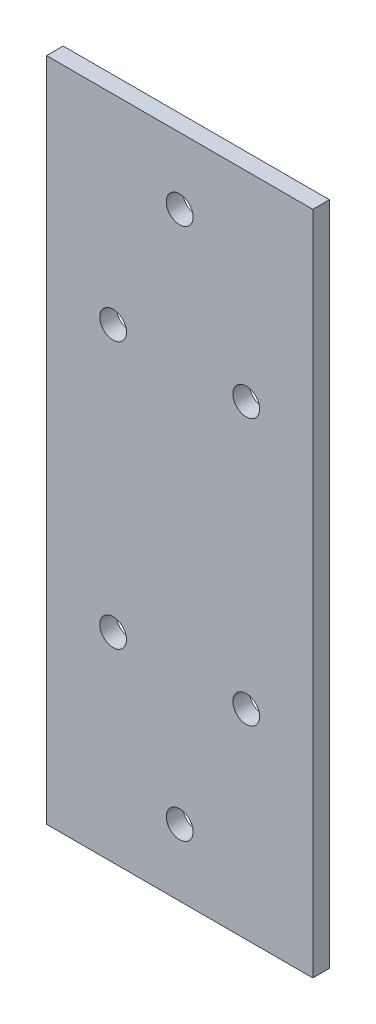
ISO-10303-21;
HEADER;
FILE_DESCRIPTION(('STEP AP214'),'2;1');
FILE_NAME('part.step','',(''),(''),'','','');
FILE_SCHEMA(('AUTOMOTIVE_DESIGN { 1 0 10303 214 1 1 1 1 }'));
ENDSEC;
DATA;
#1=APPLICATION_CONTEXT('core data for automotive mechanical design processes');
#2=APPLICATION_PROTOCOL_DEFINITION('international standard','automotive_design',2000,#1);
#3=PRODUCT_CONTEXT('',#1,'mechanical');
#4=PRODUCT('Part','Part','',(#3));
#5=PRODUCT_RELATED_PRODUCT_CATEGORY('part','',(#4));
#6=PRODUCT_DEFINITION_FORMATION('','',#4);
#7=PRODUCT_DEFINITION_CONTEXT('part definition',#1,'design');
#8=PRODUCT_DEFINITION('design','',#6,#7);
#9=PRODUCT_DEFINITION_SHAPE('','',#8);
#10=(LENGTH_UNIT() NAMED_UNIT(*) SI_UNIT(.MILLI.,.METRE.));
#11=(NAMED_UNIT(*) PLANE_ANGLE_UNIT() SI_UNIT($,.RADIAN.));
#12=(NAMED_UNIT(*) SI_UNIT($,.STERADIAN.) SOLID_ANGLE_UNIT());
#13=UNCERTAINTY_MEASURE_WITH_UNIT(LENGTH_MEASURE(1.E-05),#10,'distance_accuracy_value','');
#14=(GEOMETRIC_REPRESENTATION_CONTEXT(3) GLOBAL_UNCERTAINTY_ASSIGNED_CONTEXT((#13)) GLOBAL_UNIT_ASSIGNED_CONTEXT((#10,
#11,#12)) REPRESENTATION_CONTEXT('',''));
#15=CARTESIAN_POINT('',(0.,0.,0.));
#16=DIRECTION('',(0.,0.,1.));
#17=DIRECTION('',(1.,0.,0.));
#18=AXIS2_PLACEMENT_3D('',#15,#16,#17);
#19=CARTESIAN_POINT('',(0.,0.,3.175));
#20=DIRECTION('',(0.,0.,1.));
#21=DIRECTION('',(1.,0.,0.));
#22=AXIS2_PLACEMENT_3D('',#19,#20,#21);
#23=PLANE('',#22);
#24=CARTESIAN_POINT('',(-4.54801678557969,-76.7293177283185,3.175));
#25=DIRECTION('',(0.,0.,1.));
#26=DIRECTION('',(1.,0.,0.));
#27=AXIS2_PLACEMENT_3D('',#24,#25,#26);
#28=CIRCLE('',#27,2.5527);
#29=CARTESIAN_POINT('',(-1.9953167855797,-76.7293177283185,3.175));
#30=VERTEX_POINT('',#29);
#31=EDGE_CURVE('E133',#30,#30,#28,.T.);
#32=ORIENTED_EDGE('',*,*,#31,.F.);
#33=EDGE_LOOP('',(#32));
#34=FACE_BOUND('',#33,.T.);
#35=CARTESIAN_POINT('',(-4.5480167855797,-25.9293177283185,3.175));
#36=DIRECTION('',(0.,0.,1.));
#37=DIRECTION('',(1.,0.,0.));
#38=AXIS2_PLACEMENT_3D('',#35,#36,#37);
#39=CIRCLE('',#38,2.5527);
#40=CARTESIAN_POINT('',(-1.9953167855797,-25.9293177283185,3.175));
#41=VERTEX_POINT('',#40);
#42=EDGE_CURVE('E121',#41,#41,#39,.T.);
#43=ORIENTED_EDGE('',*,*,#42,.F.);
#44=EDGE_LOOP('',(#43));
#45=FACE_BOUND('',#44,.T.);
#46=CARTESIAN_POINT('',(-17.2480167855797,-0.529317728318502,3.175));
#47=DIRECTION('',(0.,0.,1.));
#48=DIRECTION('',(1.,0.,0.));
#49=AXIS2_PLACEMENT_3D('',#46,#47,#48);
#50=CIRCLE('',#49,2.5527);
#51=CARTESIAN_POINT('',(-14.6953167855797,-0.529317728318502,3.175));
#52=VERTEX_POINT('',#51);
#53=EDGE_CURVE('E100',#52,#52,#50,.T.);
#54=ORIENTED_EDGE('',*,*,#53,.F.);
#55=EDGE_LOOP('',(#54));
#56=FACE_BOUND('',#55,.T.);
#57=DIRECTION('',(0.,-1.,0.));
#58=VECTOR('',#57,1.);
#59=CARTESIAN_POINT('',(-42.6480167855797,12.1706822716815,3.175));
#60=LINE('',#59,#58);
#61=CARTESIAN_POINT('',(-42.6480167855797,12.1706822716815,3.175));
#62=VERTEX_POINT('',#61);
#63=CARTESIAN_POINT('',(-42.6480167855797,-114.829317728319,3.175));
#64=VERTEX_POINT('',#63);
#65=EDGE_CURVE('E85',#62,#64,#60,.T.);
#66=ORIENTED_EDGE('',*,*,#65,.T.);
#67=DIRECTION('',(1.,0.,0.));
#68=VECTOR('',#67,1.);
#69=CARTESIAN_POINT('',(-42.6480167855797,-114.829317728319,3.175));
#70=LINE('',#69,#68);
#71=CARTESIAN_POINT('',(8.15198321442031,-114.829317728319,3.175));
#72=VERTEX_POINT('',#71);
#73=EDGE_CURVE('E80',#64,#72,#70,.T.);
#74=ORIENTED_EDGE('',*,*,#73,.T.);
#75=DIRECTION('',(0.,1.,0.));
#76=VECTOR('',#75,1.);
#77=CARTESIAN_POINT('',(8.1519832144203,12.1706822716815,3.175));
#78=LINE('',#77,#76);
#79=CARTESIAN_POINT('',(8.1519832144203,12.1706822716815,3.175));
#80=VERTEX_POINT('',#79);
#81=EDGE_CURVE('E83',#72,#80,#78,.T.);
#82=ORIENTED_EDGE('',*,*,#81,.T.);
#83=DIRECTION('',(-1.,0.,0.));
#84=VECTOR('',#83,1.);
#85=CARTESIAN_POINT('',(-42.6480167855797,12.1706822716815,3.175));
#86=LINE('',#85,#84);
#87=EDGE_CURVE('E50',#80,#62,#86,.T.);
#88=ORIENTED_EDGE('',*,*,#87,.T.);
#89=EDGE_LOOP('',(#66,#74,#82,#88));
#90=FACE_BOUND('',#89,.T.);
#91=CARTESIAN_POINT('',(-29.9480167855797,-25.9293177283185,3.175));
#92=DIRECTION('',(0.,0.,1.));
#93=DIRECTION('',(1.,0.,0.));
#94=AXIS2_PLACEMENT_3D('',#91,#92,#93);
#95=CIRCLE('',#94,2.5527);
#96=CARTESIAN_POINT('',(-27.3953167855797,-25.9293177283185,3.175));
#97=VERTEX_POINT('',#96);
#98=EDGE_CURVE('E115',#97,#97,#95,.T.);
#99=ORIENTED_EDGE('',*,*,#98,.F.);
#100=EDGE_LOOP('',(#99));
#101=FACE_BOUND('',#100,.T.);
#102=CARTESIAN_POINT('',(-17.2480167855797,-102.129317728318,3.175));
#103=DIRECTION('',(0.,0.,1.));
#104=DIRECTION('',(1.,0.,0.));
#105=AXIS2_PLACEMENT_3D('',#102,#103,#104);
#106=CIRCLE('',#105,2.55269999999999);
#107=CARTESIAN_POINT('',(-14.6953167855797,-102.129317728318,3.175));
#108=VERTEX_POINT('',#107);
#109=EDGE_CURVE('E127',#108,#108,#106,.T.);
#110=ORIENTED_EDGE('',*,*,#109,.F.);
#111=EDGE_LOOP('',(#110));
#112=FACE_BOUND('',#111,.T.);
#113=CARTESIAN_POINT('',(-29.9480167855797,-76.7293177283185,3.175));
#114=DIRECTION('',(0.,0.,1.));
#115=DIRECTION('',(1.,0.,0.));
#116=AXIS2_PLACEMENT_3D('',#113,#114,#115);
#117=CIRCLE('',#116,2.55269999999999);
#118=CARTESIAN_POINT('',(-27.3953167855797,-76.7293177283185,3.175));
#119=VERTEX_POINT('',#118);
#120=EDGE_CURVE('E139',#119,#119,#117,.T.);
#121=ORIENTED_EDGE('',*,*,#120,.F.);
#122=EDGE_LOOP('',(#121));
#123=FACE_BOUND('',#122,.T.);
#124=ADVANCED_FACE('F33',(#34,#45,#56,#90,#101,#112,#123),#23,.T.);
#125=CARTESIAN_POINT('',(0.,0.,0.));
#126=DIRECTION('',(0.,0.,1.));
#127=DIRECTION('',(1.,0.,0.));
#128=AXIS2_PLACEMENT_3D('',#125,#126,#127);
#129=PLANE('',#128);
#130=DIRECTION('',(0.,-1.,0.));
#131=VECTOR('',#130,1.);
#132=CARTESIAN_POINT('',(-42.6480167855797,12.1706822716815,0.));
#133=LINE('',#132,#131);
#134=CARTESIAN_POINT('',(-42.6480167855797,12.1706822716815,0.));
#135=VERTEX_POINT('',#134);
#136=CARTESIAN_POINT('',(-42.6480167855797,-114.829317728319,0.));
#137=VERTEX_POINT('',#136);
#138=EDGE_CURVE('E97',#135,#137,#133,.T.);
#139=ORIENTED_EDGE('',*,*,#138,.F.);
#140=DIRECTION('',(-1.,0.,0.));
#141=VECTOR('',#140,1.);
#142=CARTESIAN_POINT('',(-42.6480167855797,12.1706822716815,0.));
#143=LINE('',#142,#141);
#144=CARTESIAN_POINT('',(8.1519832144203,12.1706822716815,0.));
#145=VERTEX_POINT('',#144);
#146=EDGE_CURVE('E73',#145,#135,#143,.T.);
#147=ORIENTED_EDGE('',*,*,#146,.F.);
#148=DIRECTION('',(0.,1.,0.));
#149=VECTOR('',#148,1.);
#150=CARTESIAN_POINT('',(8.1519832144203,12.1706822716815,0.));
#151=LINE('',#150,#149);
#152=CARTESIAN_POINT('',(8.15198321442031,-114.829317728319,0.));
#153=VERTEX_POINT('',#152);
#154=EDGE_CURVE('E67',#153,#145,#151,.T.);
#155=ORIENTED_EDGE('',*,*,#154,.F.);
#156=DIRECTION('',(1.,0.,0.));
#157=VECTOR('',#156,1.);
#158=CARTESIAN_POINT('',(-42.6480167855797,-114.829317728319,0.));
#159=LINE('',#158,#157);
#160=EDGE_CURVE('E89',#137,#153,#159,.T.);
#161=ORIENTED_EDGE('',*,*,#160,.F.);
#162=EDGE_LOOP('',(#139,#147,#155,#161));
#163=FACE_BOUND('',#162,.T.);
#164=CARTESIAN_POINT('',(-17.2480167855797,-0.529317728318502,0.));
#165=DIRECTION('',(0.,0.,1.));
#166=DIRECTION('',(1.,0.,0.));
#167=AXIS2_PLACEMENT_3D('',#164,#165,#166);
#168=CIRCLE('',#167,2.5527);
#169=CARTESIAN_POINT('',(-14.6953167855797,-0.529317728318502,0.));
#170=VERTEX_POINT('',#169);
#171=EDGE_CURVE('E112',#170,#170,#168,.T.);
#172=ORIENTED_EDGE('',*,*,#171,.T.);
#173=EDGE_LOOP('',(#172));
#174=FACE_BOUND('',#173,.T.);
#175=CARTESIAN_POINT('',(-29.9480167855797,-25.9293177283185,0.));
#176=DIRECTION('',(0.,0.,1.));
#177=DIRECTION('',(1.,0.,0.));
#178=AXIS2_PLACEMENT_3D('',#175,#176,#177);
#179=CIRCLE('',#178,2.5527);
#180=CARTESIAN_POINT('',(-27.3953167855797,-25.9293177283185,0.));
#181=VERTEX_POINT('',#180);
#182=EDGE_CURVE('E118',#181,#181,#179,.T.);
#183=ORIENTED_EDGE('',*,*,#182,.T.);
#184=EDGE_LOOP('',(#183));
#185=FACE_BOUND('',#184,.T.);
#186=CARTESIAN_POINT('',(-4.5480167855797,-25.9293177283185,0.));
#187=DIRECTION('',(0.,0.,1.));
#188=DIRECTION('',(1.,0.,0.));
#189=AXIS2_PLACEMENT_3D('',#186,#187,#188);
#190=CIRCLE('',#189,2.5527);
#191=CARTESIAN_POINT('',(-1.9953167855797,-25.9293177283185,0.));
#192=VERTEX_POINT('',#191);
#193=EDGE_CURVE('E124',#192,#192,#190,.T.);
#194=ORIENTED_EDGE('',*,*,#193,.T.);
#195=EDGE_LOOP('',(#194));
#196=FACE_BOUND('',#195,.T.);
#197=CARTESIAN_POINT('',(-17.2480167855797,-102.129317728318,0.));
#198=DIRECTION('',(0.,0.,1.));
#199=DIRECTION('',(1.,0.,0.));
#200=AXIS2_PLACEMENT_3D('',#197,#198,#199);
#201=CIRCLE('',#200,2.55269999999999);
#202=CARTESIAN_POINT('',(-14.6953167855797,-102.129317728318,0.));
#203=VERTEX_POINT('',#202);
#204=EDGE_CURVE('E130',#203,#203,#201,.T.);
#205=ORIENTED_EDGE('',*,*,#204,.T.);
#206=EDGE_LOOP('',(#205));
#207=FACE_BOUND('',#206,.T.);
#208=CARTESIAN_POINT('',(-4.54801678557969,-76.7293177283185,0.));
#209=DIRECTION('',(0.,0.,1.));
#210=DIRECTION('',(1.,0.,0.));
#211=AXIS2_PLACEMENT_3D('',#208,#209,#210);
#212=CIRCLE('',#211,2.5527);
#213=CARTESIAN_POINT('',(-1.9953167855797,-76.7293177283185,0.));
#214=VERTEX_POINT('',#213);
#215=EDGE_CURVE('E136',#214,#214,#212,.T.);
#216=ORIENTED_EDGE('',*,*,#215,.T.);
#217=EDGE_LOOP('',(#216));
#218=FACE_BOUND('',#217,.T.);
#219=CARTESIAN_POINT('',(-29.9480167855797,-76.7293177283185,0.));
#220=DIRECTION('',(0.,0.,1.));
#221=DIRECTION('',(1.,0.,0.));
#222=AXIS2_PLACEMENT_3D('',#219,#220,#221);
#223=CIRCLE('',#222,2.55269999999999);
#224=CARTESIAN_POINT('',(-27.3953167855797,-76.7293177283185,0.));
#225=VERTEX_POINT('',#224);
#226=EDGE_CURVE('E142',#225,#225,#223,.T.);
#227=ORIENTED_EDGE('',*,*,#226,.T.);
#228=EDGE_LOOP('',(#227));
#229=FACE_BOUND('',#228,.T.);
#230=ADVANCED_FACE('F108',(#163,#174,#185,#196,#207,#218,#229),#129,.F.);
#231=CARTESIAN_POINT('',(-42.6480167855797,12.1706822716815,3.175));
#232=DIRECTION('',(1.,0.,0.));
#233=DIRECTION('',(0.,1.,0.));
#234=AXIS2_PLACEMENT_3D('',#231,#232,#233);
#235=PLANE('',#234);
#236=ORIENTED_EDGE('',*,*,#138,.T.);
#237=DIRECTION('',(0.,0.,-1.));
#238=VECTOR('',#237,1.);
#239=CARTESIAN_POINT('',(-42.6480167855797,-114.829317728319,3.175));
#240=LINE('',#239,#238);
#241=EDGE_CURVE('E11',#64,#137,#240,.T.);
#242=ORIENTED_EDGE('',*,*,#241,.F.);
#243=ORIENTED_EDGE('',*,*,#65,.F.);
#244=DIRECTION('',(0.,0.,-1.));
#245=VECTOR('',#244,1.);
#246=CARTESIAN_POINT('',(-42.6480167855797,12.1706822716815,3.175));
#247=LINE('',#246,#245);
#248=EDGE_CURVE('E93',#62,#135,#247,.T.);
#249=ORIENTED_EDGE('',*,*,#248,.T.);
#250=EDGE_LOOP('',(#236,#242,#243,#249));
#251=FACE_BOUND('',#250,.T.);
#252=ADVANCED_FACE('F35',(#251),#235,.F.);
#253=CARTESIAN_POINT('',(-42.6480167855797,-114.829317728319,3.175));
#254=DIRECTION('',(0.,1.,0.));
#255=DIRECTION('',(0.,0.,1.));
#256=AXIS2_PLACEMENT_3D('',#253,#254,#255);
#257=PLANE('',#256);
#258=ORIENTED_EDGE('',*,*,#160,.T.);
#259=DIRECTION('',(0.,0.,-1.));
#260=VECTOR('',#259,1.);
#261=CARTESIAN_POINT('',(8.15198321442031,-114.829317728319,3.175));
#262=LINE('',#261,#260);
#263=EDGE_CURVE('E42',#72,#153,#262,.T.);
#264=ORIENTED_EDGE('',*,*,#263,.F.);
#265=ORIENTED_EDGE('',*,*,#73,.F.);
#266=ORIENTED_EDGE('',*,*,#241,.T.);
#267=EDGE_LOOP('',(#258,#264,#265,#266));
#268=FACE_BOUND('',#267,.T.);
#269=ADVANCED_FACE('F88',(#268),#257,.F.);
#270=CARTESIAN_POINT('',(8.1519832144203,12.1706822716815,3.175));
#271=DIRECTION('',(-1.,0.,0.));
#272=DIRECTION('',(0.,-1.,0.));
#273=AXIS2_PLACEMENT_3D('',#270,#271,#272);
#274=PLANE('',#273);
#275=ORIENTED_EDGE('',*,*,#154,.T.);
#276=DIRECTION('',(0.,0.,-1.));
#277=VECTOR('',#276,1.);
#278=CARTESIAN_POINT('',(8.1519832144203,12.1706822716815,3.175));
#279=LINE('',#278,#277);
#280=EDGE_CURVE('E90',#80,#145,#279,.T.);
#281=ORIENTED_EDGE('',*,*,#280,.F.);
#282=ORIENTED_EDGE('',*,*,#81,.F.);
#283=ORIENTED_EDGE('',*,*,#263,.T.);
#284=EDGE_LOOP('',(#275,#281,#282,#283));
#285=FACE_BOUND('',#284,.T.);
#286=ADVANCED_FACE('F91',(#285),#274,.F.);
#287=CARTESIAN_POINT('',(-42.6480167855797,12.1706822716815,3.175));
#288=DIRECTION('',(0.,-1.,0.));
#289=DIRECTION('',(0.,0.,-1.));
#290=AXIS2_PLACEMENT_3D('',#287,#288,#289);
#291=PLANE('',#290);
#292=ORIENTED_EDGE('',*,*,#146,.T.);
#293=ORIENTED_EDGE('',*,*,#248,.F.);
#294=ORIENTED_EDGE('',*,*,#87,.F.);
#295=ORIENTED_EDGE('',*,*,#280,.T.);
#296=EDGE_LOOP('',(#292,#293,#294,#295));
#297=FACE_BOUND('',#296,.T.);
#298=ADVANCED_FACE('F105',(#297),#291,.F.);
#299=CARTESIAN_POINT('',(-17.2480167855797,-0.529317728318502,3.175));
#300=DIRECTION('',(0.,0.,-1.));
#301=DIRECTION('',(-1.,0.,0.));
#302=AXIS2_PLACEMENT_3D('',#299,#300,#301);
#303=CYLINDRICAL_SURFACE('',#302,2.5527);
#304=ORIENTED_EDGE('',*,*,#53,.T.);
#305=EDGE_LOOP('',(#304));
#306=FACE_BOUND('',#305,.T.);
#307=ORIENTED_EDGE('',*,*,#171,.F.);
#308=EDGE_LOOP('',(#307));
#309=FACE_BOUND('',#308,.T.);
#310=ADVANCED_FACE('F161',(#306,#309),#303,.F.);
#311=CARTESIAN_POINT('',(-29.9480167855797,-25.9293177283185,3.175));
#312=DIRECTION('',(0.,0.,-1.));
#313=DIRECTION('',(-1.,0.,0.));
#314=AXIS2_PLACEMENT_3D('',#311,#312,#313);
#315=CYLINDRICAL_SURFACE('',#314,2.5527);
#316=ORIENTED_EDGE('',*,*,#98,.T.);
#317=EDGE_LOOP('',(#316));
#318=FACE_BOUND('',#317,.T.);
#319=ORIENTED_EDGE('',*,*,#182,.F.);
#320=EDGE_LOOP('',(#319));
#321=FACE_BOUND('',#320,.T.);
#322=ADVANCED_FACE('F207',(#318,#321),#315,.F.);
#323=CARTESIAN_POINT('',(-4.5480167855797,-25.9293177283185,3.175));
#324=DIRECTION('',(0.,0.,-1.));
#325=DIRECTION('',(-1.,0.,0.));
#326=AXIS2_PLACEMENT_3D('',#323,#324,#325);
#327=CYLINDRICAL_SURFACE('',#326,2.5527);
#328=ORIENTED_EDGE('',*,*,#42,.T.);
#329=EDGE_LOOP('',(#328));
#330=FACE_BOUND('',#329,.T.);
#331=ORIENTED_EDGE('',*,*,#193,.F.);
#332=EDGE_LOOP('',(#331));
#333=FACE_BOUND('',#332,.T.);
#334=ADVANCED_FACE('F215',(#330,#333),#327,.F.);
#335=CARTESIAN_POINT('',(-17.2480167855797,-102.129317728318,3.175));
#336=DIRECTION('',(0.,0.,-1.));
#337=DIRECTION('',(-1.,0.,0.));
#338=AXIS2_PLACEMENT_3D('',#335,#336,#337);
#339=CYLINDRICAL_SURFACE('',#338,2.55269999999999);
#340=ORIENTED_EDGE('',*,*,#109,.T.);
#341=EDGE_LOOP('',(#340));
#342=FACE_BOUND('',#341,.T.);
#343=ORIENTED_EDGE('',*,*,#204,.F.);
#344=EDGE_LOOP('',(#343));
#345=FACE_BOUND('',#344,.T.);
#346=ADVANCED_FACE('F223',(#342,#345),#339,.F.);
#347=CARTESIAN_POINT('',(-4.54801678557969,-76.7293177283185,3.175));
#348=DIRECTION('',(0.,0.,-1.));
#349=DIRECTION('',(-1.,0.,0.));
#350=AXIS2_PLACEMENT_3D('',#347,#348,#349);
#351=CYLINDRICAL_SURFACE('',#350,2.5527);
#352=ORIENTED_EDGE('',*,*,#31,.T.);
#353=EDGE_LOOP('',(#352));
#354=FACE_BOUND('',#353,.T.);
#355=ORIENTED_EDGE('',*,*,#215,.F.);
#356=EDGE_LOOP('',(#355));
#357=FACE_BOUND('',#356,.T.);
#358=ADVANCED_FACE('F232',(#354,#357),#351,.F.);
#359=CARTESIAN_POINT('',(-29.9480167855797,-76.7293177283185,3.175));
#360=DIRECTION('',(0.,0.,-1.));
#361=DIRECTION('',(-1.,0.,0.));
#362=AXIS2_PLACEMENT_3D('',#359,#360,#361);
#363=CYLINDRICAL_SURFACE('',#362,2.55269999999999);
#364=ORIENTED_EDGE('',*,*,#120,.T.);
#365=EDGE_LOOP('',(#364));
#366=FACE_BOUND('',#365,.T.);
#367=ORIENTED_EDGE('',*,*,#226,.F.);
#368=EDGE_LOOP('',(#367));
#369=FACE_BOUND('',#368,.T.);
#370=ADVANCED_FACE('F148',(#366,#369),#363,.F.);
#371=CLOSED_SHELL('',(#124,#230,#252,#269,#286,#298,#310,#322,#334,#346,#358,#370));
#372=MANIFOLD_SOLID_BREP('B2',#371);
#373=ADVANCED_BREP_SHAPE_REPRESENTATION('',(#18,#372),#14);
#374=SHAPE_DEFINITION_REPRESENTATION(#9,#373);
ENDSEC;
END-ISO-10303-21;
